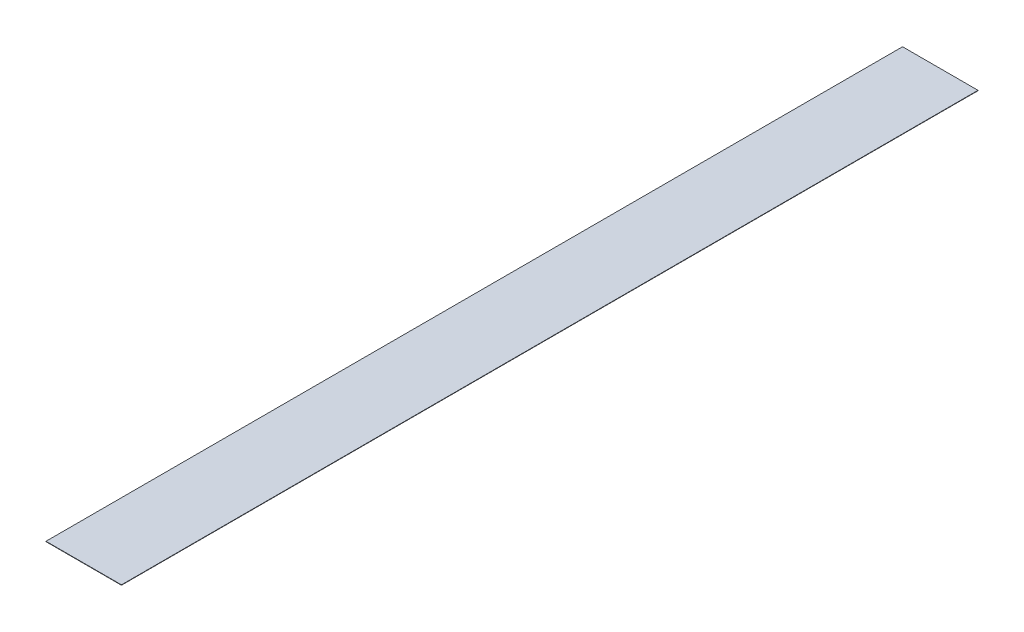
ISO-10303-21;
HEADER;
FILE_DESCRIPTION(('STEP AP214'),'2;1');
FILE_NAME('part.step','',(''),(''),'','','');
FILE_SCHEMA(('AUTOMOTIVE_DESIGN { 1 0 10303 214 1 1 1 1 }'));
ENDSEC;
DATA;
#1=APPLICATION_CONTEXT('core data for automotive mechanical design processes');
#2=APPLICATION_PROTOCOL_DEFINITION('international standard','automotive_design',2000,#1);
#3=PRODUCT_CONTEXT('',#1,'mechanical');
#4=PRODUCT('Part','Part','',(#3));
#5=PRODUCT_RELATED_PRODUCT_CATEGORY('part','',(#4));
#6=PRODUCT_DEFINITION_FORMATION('','',#4);
#7=PRODUCT_DEFINITION_CONTEXT('part definition',#1,'design');
#8=PRODUCT_DEFINITION('design','',#6,#7);
#9=PRODUCT_DEFINITION_SHAPE('','',#8);
#10=(LENGTH_UNIT() NAMED_UNIT(*) SI_UNIT(.MILLI.,.METRE.));
#11=(NAMED_UNIT(*) PLANE_ANGLE_UNIT() SI_UNIT($,.RADIAN.));
#12=(NAMED_UNIT(*) SI_UNIT($,.STERADIAN.) SOLID_ANGLE_UNIT());
#13=UNCERTAINTY_MEASURE_WITH_UNIT(LENGTH_MEASURE(1.E-05),#10,'distance_accuracy_value','');
#14=(GEOMETRIC_REPRESENTATION_CONTEXT(3) GLOBAL_UNCERTAINTY_ASSIGNED_CONTEXT((#13)) GLOBAL_UNIT_ASSIGNED_CONTEXT((#10,
#11,#12)) REPRESENTATION_CONTEXT('',''));
#15=CARTESIAN_POINT('',(0.,0.,0.));
#16=DIRECTION('',(0.,0.,1.));
#17=DIRECTION('',(1.,0.,0.));
#18=AXIS2_PLACEMENT_3D('',#15,#16,#17);
#19=CARTESIAN_POINT('',(-975.,641.75,-2270.));
#20=DIRECTION('',(1.,0.,0.));
#21=DIRECTION('',(0.,0.,-1.));
#22=AXIS2_PLACEMENT_3D('',#19,#20,#21);
#23=PLANE('',#22);
#24=DIRECTION('',(0.,0.,1.));
#25=VECTOR('',#24,1.);
#26=CARTESIAN_POINT('',(-975.,639.75,-2270.));
#27=LINE('',#26,#25);
#28=CARTESIAN_POINT('',(-975.,639.75,-2270.));
#29=VERTEX_POINT('',#28);
#30=CARTESIAN_POINT('',(-975.,639.75,2270.));
#31=VERTEX_POINT('',#30);
#32=EDGE_CURVE('E96',#29,#31,#27,.T.);
#33=ORIENTED_EDGE('',*,*,#32,.T.);
#34=DIRECTION('',(0.,-1.,0.));
#35=VECTOR('',#34,1.);
#36=CARTESIAN_POINT('',(-975.,641.75,2270.));
#37=LINE('',#36,#35);
#38=CARTESIAN_POINT('',(-975.,641.75,2270.));
#39=VERTEX_POINT('',#38);
#40=EDGE_CURVE('E11',#39,#31,#37,.T.);
#41=ORIENTED_EDGE('',*,*,#40,.F.);
#42=DIRECTION('',(0.,0.,1.));
#43=VECTOR('',#42,1.);
#44=CARTESIAN_POINT('',(-975.,641.75,-2270.));
#45=LINE('',#44,#43);
#46=CARTESIAN_POINT('',(-975.,641.75,-2270.));
#47=VERTEX_POINT('',#46);
#48=EDGE_CURVE('E84',#47,#39,#45,.T.);
#49=ORIENTED_EDGE('',*,*,#48,.F.);
#50=DIRECTION('',(0.,-1.,0.));
#51=VECTOR('',#50,1.);
#52=CARTESIAN_POINT('',(-975.,641.75,-2270.));
#53=LINE('',#52,#51);
#54=EDGE_CURVE('E92',#47,#29,#53,.T.);
#55=ORIENTED_EDGE('',*,*,#54,.T.);
#56=EDGE_LOOP('',(#33,#41,#49,#55));
#57=FACE_BOUND('',#56,.T.);
#58=ADVANCED_FACE('F33',(#57),#23,.F.);
#59=CARTESIAN_POINT('',(-975.,641.75,2270.));
#60=DIRECTION('',(0.,0.,-1.));
#61=DIRECTION('',(-1.,0.,0.));
#62=AXIS2_PLACEMENT_3D('',#59,#60,#61);
#63=PLANE('',#62);
#64=DIRECTION('',(1.,0.,0.));
#65=VECTOR('',#64,1.);
#66=CARTESIAN_POINT('',(-975.,639.75,2270.));
#67=LINE('',#66,#65);
#68=CARTESIAN_POINT('',(-574.999999999999,639.75,2270.));
#69=VERTEX_POINT('',#68);
#70=EDGE_CURVE('E88',#31,#69,#67,.T.);
#71=ORIENTED_EDGE('',*,*,#70,.T.);
#72=DIRECTION('',(0.,-1.,0.));
#73=VECTOR('',#72,1.);
#74=CARTESIAN_POINT('',(-574.999999999999,641.75,2270.));
#75=LINE('',#74,#73);
#76=CARTESIAN_POINT('',(-574.999999999999,641.75,2270.));
#77=VERTEX_POINT('',#76);
#78=EDGE_CURVE('E41',#77,#69,#75,.T.);
#79=ORIENTED_EDGE('',*,*,#78,.F.);
#80=DIRECTION('',(1.,0.,0.));
#81=VECTOR('',#80,1.);
#82=CARTESIAN_POINT('',(-975.,641.75,2270.));
#83=LINE('',#82,#81);
#84=EDGE_CURVE('E79',#39,#77,#83,.T.);
#85=ORIENTED_EDGE('',*,*,#84,.F.);
#86=ORIENTED_EDGE('',*,*,#40,.T.);
#87=EDGE_LOOP('',(#71,#79,#85,#86));
#88=FACE_BOUND('',#87,.T.);
#89=ADVANCED_FACE('F87',(#88),#63,.F.);
#90=CARTESIAN_POINT('',(-575.,641.75,-2270.));
#91=DIRECTION('',(-1.,0.,0.));
#92=DIRECTION('',(0.,0.,1.));
#93=AXIS2_PLACEMENT_3D('',#90,#91,#92);
#94=PLANE('',#93);
#95=DIRECTION('',(0.,0.,-1.));
#96=VECTOR('',#95,1.);
#97=CARTESIAN_POINT('',(-575.,639.75,-2270.));
#98=LINE('',#97,#96);
#99=CARTESIAN_POINT('',(-575.,639.75,-2270.));
#100=VERTEX_POINT('',#99);
#101=EDGE_CURVE('E66',#69,#100,#98,.T.);
#102=ORIENTED_EDGE('',*,*,#101,.T.);
#103=DIRECTION('',(0.,-1.,0.));
#104=VECTOR('',#103,1.);
#105=CARTESIAN_POINT('',(-575.,641.75,-2270.));
#106=LINE('',#105,#104);
#107=CARTESIAN_POINT('',(-575.,641.75,-2270.));
#108=VERTEX_POINT('',#107);
#109=EDGE_CURVE('E89',#108,#100,#106,.T.);
#110=ORIENTED_EDGE('',*,*,#109,.F.);
#111=DIRECTION('',(0.,0.,-1.));
#112=VECTOR('',#111,1.);
#113=CARTESIAN_POINT('',(-575.,641.75,-2270.));
#114=LINE('',#113,#112);
#115=EDGE_CURVE('E82',#77,#108,#114,.T.);
#116=ORIENTED_EDGE('',*,*,#115,.F.);
#117=ORIENTED_EDGE('',*,*,#78,.T.);
#118=EDGE_LOOP('',(#102,#110,#116,#117));
#119=FACE_BOUND('',#118,.T.);
#120=ADVANCED_FACE('F90',(#119),#94,.F.);
#121=CARTESIAN_POINT('',(-975.,641.75,-2270.));
#122=DIRECTION('',(0.,0.,1.));
#123=DIRECTION('',(1.,0.,0.));
#124=AXIS2_PLACEMENT_3D('',#121,#122,#123);
#125=PLANE('',#124);
#126=DIRECTION('',(-1.,0.,0.));
#127=VECTOR('',#126,1.);
#128=CARTESIAN_POINT('',(-975.,639.75,-2270.));
#129=LINE('',#128,#127);
#130=EDGE_CURVE('E72',#100,#29,#129,.T.);
#131=ORIENTED_EDGE('',*,*,#130,.T.);
#132=ORIENTED_EDGE('',*,*,#54,.F.);
#133=DIRECTION('',(-1.,0.,0.));
#134=VECTOR('',#133,1.);
#135=CARTESIAN_POINT('',(-975.,641.75,-2270.));
#136=LINE('',#135,#134);
#137=EDGE_CURVE('E49',#108,#47,#136,.T.);
#138=ORIENTED_EDGE('',*,*,#137,.F.);
#139=ORIENTED_EDGE('',*,*,#109,.T.);
#140=EDGE_LOOP('',(#131,#132,#138,#139));
#141=FACE_BOUND('',#140,.T.);
#142=ADVANCED_FACE('F103',(#141),#125,.F.);
#143=CARTESIAN_POINT('',(0.,641.75,0.));
#144=DIRECTION('',(0.,1.,0.));
#145=DIRECTION('',(0.,0.,1.));
#146=AXIS2_PLACEMENT_3D('',#143,#144,#145);
#147=PLANE('',#146);
#148=ORIENTED_EDGE('',*,*,#48,.T.);
#149=ORIENTED_EDGE('',*,*,#84,.T.);
#150=ORIENTED_EDGE('',*,*,#115,.T.);
#151=ORIENTED_EDGE('',*,*,#137,.T.);
#152=EDGE_LOOP('',(#148,#149,#150,#151));
#153=FACE_BOUND('',#152,.T.);
#154=ADVANCED_FACE('F80',(#153),#147,.T.);
#155=CARTESIAN_POINT('',(0.,639.75,0.));
#156=DIRECTION('',(0.,1.,0.));
#157=DIRECTION('',(0.,0.,1.));
#158=AXIS2_PLACEMENT_3D('',#155,#156,#157);
#159=PLANE('',#158);
#160=ORIENTED_EDGE('',*,*,#32,.F.);
#161=ORIENTED_EDGE('',*,*,#130,.F.);
#162=ORIENTED_EDGE('',*,*,#101,.F.);
#163=ORIENTED_EDGE('',*,*,#70,.F.);
#164=EDGE_LOOP('',(#160,#161,#162,#163));
#165=FACE_BOUND('',#164,.T.);
#166=ADVANCED_FACE('F106',(#165),#159,.F.);
#167=CLOSED_SHELL('',(#58,#89,#120,#142,#154,#166));
#168=MANIFOLD_SOLID_BREP('B2',#167);
#169=ADVANCED_BREP_SHAPE_REPRESENTATION('',(#18,#168),#14);
#170=SHAPE_DEFINITION_REPRESENTATION(#9,#169);
ENDSEC;
END-ISO-10303-21;
